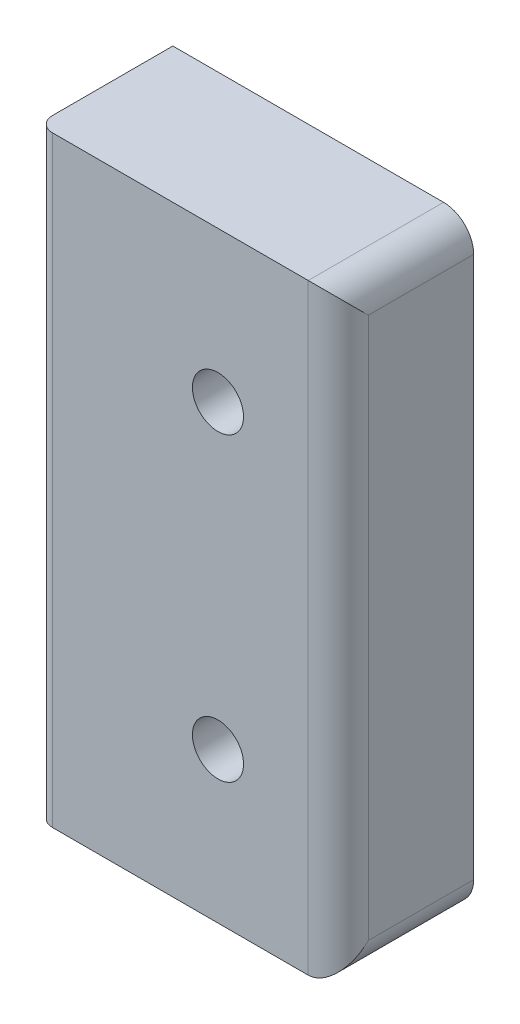
ISO-10303-21;
HEADER;
FILE_DESCRIPTION(('STEP AP214'),'2;1');
FILE_NAME('part.step','',(''),(''),'','','');
FILE_SCHEMA(('AUTOMOTIVE_DESIGN { 1 0 10303 214 1 1 1 1 }'));
ENDSEC;
DATA;
#1=APPLICATION_CONTEXT('core data for automotive mechanical design processes');
#2=APPLICATION_PROTOCOL_DEFINITION('international standard','automotive_design',2000,#1);
#3=PRODUCT_CONTEXT('',#1,'mechanical');
#4=PRODUCT('Part','Part','',(#3));
#5=PRODUCT_RELATED_PRODUCT_CATEGORY('part','',(#4));
#6=PRODUCT_DEFINITION_FORMATION('','',#4);
#7=PRODUCT_DEFINITION_CONTEXT('part definition',#1,'design');
#8=PRODUCT_DEFINITION('design','',#6,#7);
#9=PRODUCT_DEFINITION_SHAPE('','',#8);
#10=(LENGTH_UNIT() NAMED_UNIT(*) SI_UNIT(.MILLI.,.METRE.));
#11=(NAMED_UNIT(*) PLANE_ANGLE_UNIT() SI_UNIT($,.RADIAN.));
#12=(NAMED_UNIT(*) SI_UNIT($,.STERADIAN.) SOLID_ANGLE_UNIT());
#13=UNCERTAINTY_MEASURE_WITH_UNIT(LENGTH_MEASURE(1.E-05),#10,'distance_accuracy_value','');
#14=(GEOMETRIC_REPRESENTATION_CONTEXT(3) GLOBAL_UNCERTAINTY_ASSIGNED_CONTEXT((#13)) GLOBAL_UNIT_ASSIGNED_CONTEXT((#10,
#11,#12)) REPRESENTATION_CONTEXT('',''));
#15=CARTESIAN_POINT('',(0.,0.,0.));
#16=DIRECTION('',(0.,0.,1.));
#17=DIRECTION('',(1.,0.,0.));
#18=AXIS2_PLACEMENT_3D('',#15,#16,#17);
#19=CARTESIAN_POINT('',(10.,0.,9.));
#20=DIRECTION('',(0.,-1.,0.));
#21=DIRECTION('',(0.,0.,-1.));
#22=AXIS2_PLACEMENT_3D('',#19,#20,#21);
#23=PLANE('',#22);
#24=DIRECTION('',(-1.,0.,0.));
#25=VECTOR('',#24,1.);
#26=CARTESIAN_POINT('',(10.,0.,0.));
#27=LINE('',#26,#25);
#28=CARTESIAN_POINT('',(8.,0.,0.));
#29=VERTEX_POINT('',#28);
#30=CARTESIAN_POINT('',(-10.,0.,0.));
#31=VERTEX_POINT('',#30);
#32=EDGE_CURVE('E96',#29,#31,#27,.T.);
#33=ORIENTED_EDGE('',*,*,#32,.F.);
#34=DIRECTION('',(0.,0.,-1.));
#35=VECTOR('',#34,1.);
#36=CARTESIAN_POINT('',(8.,0.,9.));
#37=LINE('',#36,#35);
#38=CARTESIAN_POINT('',(8.,0.,9.));
#39=VERTEX_POINT('',#38);
#40=EDGE_CURVE('E59',#29,#39,#37,.F.);
#41=ORIENTED_EDGE('',*,*,#40,.T.);
#42=DIRECTION('',(-1.,0.,0.));
#43=VECTOR('',#42,1.);
#44=CARTESIAN_POINT('',(10.,0.,9.));
#45=LINE('',#44,#43);
#46=CARTESIAN_POINT('',(-9.,0.,9.));
#47=VERTEX_POINT('',#46);
#48=EDGE_CURVE('E126',#39,#47,#45,.T.);
#49=ORIENTED_EDGE('',*,*,#48,.T.);
#50=CARTESIAN_POINT('',(-9.,0.,8.));
#51=DIRECTION('',(0.,-1.,0.));
#52=DIRECTION('',(0.,0.,-1.));
#53=AXIS2_PLACEMENT_3D('',#50,#51,#52);
#54=CIRCLE('',#53,1.);
#55=CARTESIAN_POINT('',(-10.,0.,8.));
#56=VERTEX_POINT('',#55);
#57=EDGE_CURVE('E109',#47,#56,#54,.T.);
#58=ORIENTED_EDGE('',*,*,#57,.T.);
#59=DIRECTION('',(0.,0.,-1.));
#60=VECTOR('',#59,1.);
#61=CARTESIAN_POINT('',(-10.,0.,9.));
#62=LINE('',#61,#60);
#63=EDGE_CURVE('E107',#56,#31,#62,.T.);
#64=ORIENTED_EDGE('',*,*,#63,.T.);
#65=EDGE_LOOP('',(#33,#41,#49,#58,#64));
#66=FACE_BOUND('',#65,.T.);
#67=ADVANCED_FACE('F36',(#66),#23,.T.);
#68=CARTESIAN_POINT('',(10.,40.,9.));
#69=DIRECTION('',(1.,0.,0.));
#70=DIRECTION('',(0.,0.,-1.));
#71=AXIS2_PLACEMENT_3D('',#68,#69,#70);
#72=PLANE('',#71);
#73=DIRECTION('',(0.,-1.,0.));
#74=VECTOR('',#73,1.);
#75=CARTESIAN_POINT('',(10.,0.,7.));
#76=LINE('',#75,#74);
#77=CARTESIAN_POINT('',(10.,38.,7.));
#78=VERTEX_POINT('',#77);
#79=CARTESIAN_POINT('',(10.,2.,7.));
#80=VERTEX_POINT('',#79);
#81=EDGE_CURVE('E136',#78,#80,#76,.T.);
#82=ORIENTED_EDGE('',*,*,#81,.T.);
#83=DIRECTION('',(0.,0.,-1.));
#84=VECTOR('',#83,1.);
#85=CARTESIAN_POINT('',(10.,2.,9.));
#86=LINE('',#85,#84);
#87=CARTESIAN_POINT('',(10.,2.,0.));
#88=VERTEX_POINT('',#87);
#89=EDGE_CURVE('E140',#80,#88,#86,.T.);
#90=ORIENTED_EDGE('',*,*,#89,.T.);
#91=DIRECTION('',(0.,-1.,0.));
#92=VECTOR('',#91,1.);
#93=CARTESIAN_POINT('',(10.,40.,0.));
#94=LINE('',#93,#92);
#95=CARTESIAN_POINT('',(10.,38.,0.));
#96=VERTEX_POINT('',#95);
#97=EDGE_CURVE('E121',#96,#88,#94,.T.);
#98=ORIENTED_EDGE('',*,*,#97,.F.);
#99=DIRECTION('',(0.,0.,-1.));
#100=VECTOR('',#99,1.);
#101=CARTESIAN_POINT('',(10.,38.,9.));
#102=LINE('',#101,#100);
#103=EDGE_CURVE('E138',#96,#78,#102,.F.);
#104=ORIENTED_EDGE('',*,*,#103,.T.);
#105=EDGE_LOOP('',(#82,#90,#98,#104));
#106=FACE_BOUND('',#105,.T.);
#107=ADVANCED_FACE('F209',(#106),#72,.T.);
#108=CARTESIAN_POINT('',(-10.,40.,9.));
#109=DIRECTION('',(0.,1.,0.));
#110=DIRECTION('',(0.,0.,1.));
#111=AXIS2_PLACEMENT_3D('',#108,#109,#110);
#112=PLANE('',#111);
#113=DIRECTION('',(1.,0.,0.));
#114=VECTOR('',#113,1.);
#115=CARTESIAN_POINT('',(-10.,40.,9.));
#116=LINE('',#115,#114);
#117=CARTESIAN_POINT('',(-9.,40.,9.));
#118=VERTEX_POINT('',#117);
#119=CARTESIAN_POINT('',(8.,40.,9.));
#120=VERTEX_POINT('',#119);
#121=EDGE_CURVE('E114',#118,#120,#116,.T.);
#122=ORIENTED_EDGE('',*,*,#121,.T.);
#123=DIRECTION('',(0.,0.,-1.));
#124=VECTOR('',#123,1.);
#125=CARTESIAN_POINT('',(8.,40.,9.));
#126=LINE('',#125,#124);
#127=CARTESIAN_POINT('',(8.,40.,0.));
#128=VERTEX_POINT('',#127);
#129=EDGE_CURVE('E45',#120,#128,#126,.T.);
#130=ORIENTED_EDGE('',*,*,#129,.T.);
#131=DIRECTION('',(1.,0.,0.));
#132=VECTOR('',#131,1.);
#133=CARTESIAN_POINT('',(-10.,40.,0.));
#134=LINE('',#133,#132);
#135=CARTESIAN_POINT('',(-10.,40.,0.));
#136=VERTEX_POINT('',#135);
#137=EDGE_CURVE('E119',#136,#128,#134,.T.);
#138=ORIENTED_EDGE('',*,*,#137,.F.);
#139=DIRECTION('',(0.,0.,-1.));
#140=VECTOR('',#139,1.);
#141=CARTESIAN_POINT('',(-10.,40.,9.));
#142=LINE('',#141,#140);
#143=CARTESIAN_POINT('',(-10.,40.,8.));
#144=VERTEX_POINT('',#143);
#145=EDGE_CURVE('E113',#144,#136,#142,.T.);
#146=ORIENTED_EDGE('',*,*,#145,.F.);
#147=CARTESIAN_POINT('',(-9.,40.,8.));
#148=DIRECTION('',(0.,1.,0.));
#149=DIRECTION('',(0.,0.,1.));
#150=AXIS2_PLACEMENT_3D('',#147,#148,#149);
#151=CIRCLE('',#150,1.);
#152=EDGE_CURVE('E130',#144,#118,#151,.T.);
#153=ORIENTED_EDGE('',*,*,#152,.T.);
#154=EDGE_LOOP('',(#122,#130,#138,#146,#153));
#155=FACE_BOUND('',#154,.T.);
#156=ADVANCED_FACE('F202',(#155),#112,.T.);
#157=CARTESIAN_POINT('',(-10.,0.,9.));
#158=DIRECTION('',(-1.,0.,0.));
#159=DIRECTION('',(0.,0.,1.));
#160=AXIS2_PLACEMENT_3D('',#157,#158,#159);
#161=PLANE('',#160);
#162=CARTESIAN_POINT('',(-10.,25.,4.49999999999423));
#163=DIRECTION('',(-1.,0.,0.));
#164=DIRECTION('',(0.,0.,1.));
#165=AXIS2_PLACEMENT_3D('',#162,#163,#164);
#166=CIRCLE('',#165,2.);
#167=CARTESIAN_POINT('',(-10.,25.,6.49999999999423));
#168=VERTEX_POINT('',#167);
#169=EDGE_CURVE('E177',#168,#168,#166,.T.);
#170=ORIENTED_EDGE('',*,*,#169,.F.);
#171=EDGE_LOOP('',(#170));
#172=FACE_BOUND('',#171,.T.);
#173=CARTESIAN_POINT('',(-10.,5.00000000000016,4.49999999999425));
#174=DIRECTION('',(-1.,0.,0.));
#175=DIRECTION('',(0.,0.,1.));
#176=AXIS2_PLACEMENT_3D('',#173,#174,#175);
#177=CIRCLE('',#176,2.);
#178=CARTESIAN_POINT('',(-10.,5.00000000000016,6.49999999999425));
#179=VERTEX_POINT('',#178);
#180=EDGE_CURVE('E183',#179,#179,#177,.T.);
#181=ORIENTED_EDGE('',*,*,#180,.F.);
#182=EDGE_LOOP('',(#181));
#183=FACE_BOUND('',#182,.T.);
#184=CARTESIAN_POINT('',(-10.,15.,4.49999999999424));
#185=DIRECTION('',(-1.,0.,0.));
#186=DIRECTION('',(0.,0.,1.));
#187=AXIS2_PLACEMENT_3D('',#184,#185,#186);
#188=CIRCLE('',#187,2.);
#189=CARTESIAN_POINT('',(-10.,15.,6.49999999999424));
#190=VERTEX_POINT('',#189);
#191=EDGE_CURVE('E189',#190,#190,#188,.T.);
#192=ORIENTED_EDGE('',*,*,#191,.F.);
#193=EDGE_LOOP('',(#192));
#194=FACE_BOUND('',#193,.T.);
#195=CARTESIAN_POINT('',(-10.,35.,4.49999999999424));
#196=DIRECTION('',(-1.,0.,0.));
#197=DIRECTION('',(0.,0.,1.));
#198=AXIS2_PLACEMENT_3D('',#195,#196,#197);
#199=CIRCLE('',#198,2.);
#200=CARTESIAN_POINT('',(-10.,35.,6.49999999999424));
#201=VERTEX_POINT('',#200);
#202=EDGE_CURVE('E195',#201,#201,#199,.T.);
#203=ORIENTED_EDGE('',*,*,#202,.F.);
#204=EDGE_LOOP('',(#203));
#205=FACE_BOUND('',#204,.T.);
#206=ORIENTED_EDGE('',*,*,#63,.F.);
#207=DIRECTION('',(0.,1.,0.));
#208=VECTOR('',#207,1.);
#209=CARTESIAN_POINT('',(-10.,40.,8.));
#210=LINE('',#209,#208);
#211=EDGE_CURVE('E127',#56,#144,#210,.T.);
#212=ORIENTED_EDGE('',*,*,#211,.T.);
#213=ORIENTED_EDGE('',*,*,#145,.T.);
#214=DIRECTION('',(0.,1.,0.));
#215=VECTOR('',#214,1.);
#216=CARTESIAN_POINT('',(-10.,0.,0.));
#217=LINE('',#216,#215);
#218=EDGE_CURVE('E102',#31,#136,#217,.T.);
#219=ORIENTED_EDGE('',*,*,#218,.F.);
#220=EDGE_LOOP('',(#206,#212,#213,#219));
#221=FACE_BOUND('',#220,.T.);
#222=ADVANCED_FACE('F116',(#172,#183,#194,#205,#221),#161,.T.);
#223=CARTESIAN_POINT('',(0.,0.,9.));
#224=DIRECTION('',(0.,0.,-1.));
#225=DIRECTION('',(-1.,0.,0.));
#226=AXIS2_PLACEMENT_3D('',#223,#224,#225);
#227=PLANE('',#226);
#228=CARTESIAN_POINT('',(2.,30.,9.));
#229=DIRECTION('',(0.,0.,-1.));
#230=DIRECTION('',(-1.,0.,0.));
#231=AXIS2_PLACEMENT_3D('',#228,#229,#230);
#232=CIRCLE('',#231,1.7);
#233=CARTESIAN_POINT('',(0.300000000000004,30.,9.));
#234=VERTEX_POINT('',#233);
#235=EDGE_CURVE('E163',#234,#234,#232,.T.);
#236=ORIENTED_EDGE('',*,*,#235,.T.);
#237=EDGE_LOOP('',(#236));
#238=FACE_BOUND('',#237,.T.);
#239=CARTESIAN_POINT('',(2.,10.,9.));
#240=DIRECTION('',(0.,0.,-1.));
#241=DIRECTION('',(-1.,0.,0.));
#242=AXIS2_PLACEMENT_3D('',#239,#240,#241);
#243=CIRCLE('',#242,1.7);
#244=CARTESIAN_POINT('',(0.300000000000004,10.,9.));
#245=VERTEX_POINT('',#244);
#246=EDGE_CURVE('E174',#245,#245,#243,.T.);
#247=ORIENTED_EDGE('',*,*,#246,.T.);
#248=EDGE_LOOP('',(#247));
#249=FACE_BOUND('',#248,.T.);
#250=ORIENTED_EDGE('',*,*,#48,.F.);
#251=DIRECTION('',(0.,-1.,0.));
#252=VECTOR('',#251,1.);
#253=CARTESIAN_POINT('',(8.,40.,9.));
#254=LINE('',#253,#252);
#255=EDGE_CURVE('E11',#39,#120,#254,.F.);
#256=ORIENTED_EDGE('',*,*,#255,.T.);
#257=ORIENTED_EDGE('',*,*,#121,.F.);
#258=DIRECTION('',(0.,1.,0.));
#259=VECTOR('',#258,1.);
#260=CARTESIAN_POINT('',(-9.,0.,9.));
#261=LINE('',#260,#259);
#262=EDGE_CURVE('E132',#118,#47,#261,.F.);
#263=ORIENTED_EDGE('',*,*,#262,.T.);
#264=EDGE_LOOP('',(#250,#256,#257,#263));
#265=FACE_BOUND('',#264,.T.);
#266=ADVANCED_FACE('F237',(#238,#249,#265),#227,.F.);
#267=CARTESIAN_POINT('',(0.,0.,0.));
#268=DIRECTION('',(0.,0.,-1.));
#269=DIRECTION('',(-1.,0.,0.));
#270=AXIS2_PLACEMENT_3D('',#267,#268,#269);
#271=PLANE('',#270);
#272=CARTESIAN_POINT('',(2.,30.,0.));
#273=DIRECTION('',(0.,0.,-1.));
#274=DIRECTION('',(-1.,0.,0.));
#275=AXIS2_PLACEMENT_3D('',#272,#273,#274);
#276=CIRCLE('',#275,2.75);
#277=CARTESIAN_POINT('',(-0.749999999999999,30.,0.));
#278=VERTEX_POINT('',#277);
#279=EDGE_CURVE('E153',#278,#278,#276,.T.);
#280=ORIENTED_EDGE('',*,*,#279,.F.);
#281=EDGE_LOOP('',(#280));
#282=FACE_BOUND('',#281,.T.);
#283=CARTESIAN_POINT('',(2.,10.,0.));
#284=DIRECTION('',(0.,0.,-1.));
#285=DIRECTION('',(-1.,0.,0.));
#286=AXIS2_PLACEMENT_3D('',#283,#284,#285);
#287=CIRCLE('',#286,2.75);
#288=CARTESIAN_POINT('',(-0.749999999999999,10.,0.));
#289=VERTEX_POINT('',#288);
#290=EDGE_CURVE('E168',#289,#289,#287,.T.);
#291=ORIENTED_EDGE('',*,*,#290,.F.);
#292=EDGE_LOOP('',(#291));
#293=FACE_BOUND('',#292,.T.);
#294=ORIENTED_EDGE('',*,*,#97,.T.);
#295=CARTESIAN_POINT('',(8.,2.,0.));
#296=DIRECTION('',(0.,0.,-1.));
#297=DIRECTION('',(-1.,0.,0.));
#298=AXIS2_PLACEMENT_3D('',#295,#296,#297);
#299=CIRCLE('',#298,2.);
#300=EDGE_CURVE('E103',#88,#29,#299,.T.);
#301=ORIENTED_EDGE('',*,*,#300,.T.);
#302=ORIENTED_EDGE('',*,*,#32,.T.);
#303=ORIENTED_EDGE('',*,*,#218,.T.);
#304=ORIENTED_EDGE('',*,*,#137,.T.);
#305=CARTESIAN_POINT('',(8.,38.,0.));
#306=DIRECTION('',(0.,0.,-1.));
#307=DIRECTION('',(-1.,0.,0.));
#308=AXIS2_PLACEMENT_3D('',#305,#306,#307);
#309=CIRCLE('',#308,2.);
#310=EDGE_CURVE('E143',#128,#96,#309,.T.);
#311=ORIENTED_EDGE('',*,*,#310,.T.);
#312=EDGE_LOOP('',(#294,#301,#302,#303,#304,#311));
#313=FACE_BOUND('',#312,.T.);
#314=ADVANCED_FACE('F99',(#282,#293,#313),#271,.T.);
#315=CARTESIAN_POINT('',(-4.,35.,4.49999999999424));
#316=DIRECTION('',(1.,0.,0.));
#317=DIRECTION('',(0.,0.,-1.));
#318=AXIS2_PLACEMENT_3D('',#315,#316,#317);
#319=PLANE('',#318);
#320=CARTESIAN_POINT('',(-4.,35.,4.49999999999424));
#321=DIRECTION('',(-1.,0.,0.));
#322=DIRECTION('',(0.,0.,1.));
#323=AXIS2_PLACEMENT_3D('',#320,#321,#322);
#324=CIRCLE('',#323,1.99999999999999);
#325=CARTESIAN_POINT('',(-4.,35.,6.49999999999423));
#326=VERTEX_POINT('',#325);
#327=EDGE_CURVE('E104',#326,#326,#324,.T.);
#328=ORIENTED_EDGE('',*,*,#327,.T.);
#329=EDGE_LOOP('',(#328));
#330=FACE_BOUND('',#329,.T.);
#331=ADVANCED_FACE('F244',(#330),#319,.F.);
#332=CARTESIAN_POINT('',(-10.,35.,4.49999999999424));
#333=DIRECTION('',(-1.,0.,0.));
#334=DIRECTION('',(0.,0.,1.));
#335=AXIS2_PLACEMENT_3D('',#332,#333,#334);
#336=CYLINDRICAL_SURFACE('',#335,2.);
#337=ORIENTED_EDGE('',*,*,#327,.F.);
#338=EDGE_LOOP('',(#337));
#339=FACE_BOUND('',#338,.T.);
#340=ORIENTED_EDGE('',*,*,#202,.T.);
#341=EDGE_LOOP('',(#340));
#342=FACE_BOUND('',#341,.T.);
#343=ADVANCED_FACE('F327',(#339,#342),#336,.F.);
#344=CARTESIAN_POINT('',(-4.,15.,4.49999999999424));
#345=DIRECTION('',(1.,0.,0.));
#346=DIRECTION('',(0.,0.,-1.));
#347=AXIS2_PLACEMENT_3D('',#344,#345,#346);
#348=PLANE('',#347);
#349=CARTESIAN_POINT('',(-4.,15.,4.49999999999424));
#350=DIRECTION('',(-1.,0.,0.));
#351=DIRECTION('',(0.,0.,1.));
#352=AXIS2_PLACEMENT_3D('',#349,#350,#351);
#353=CIRCLE('',#352,2.);
#354=CARTESIAN_POINT('',(-4.,15.,6.49999999999424));
#355=VERTEX_POINT('',#354);
#356=EDGE_CURVE('E192',#355,#355,#353,.T.);
#357=ORIENTED_EDGE('',*,*,#356,.T.);
#358=EDGE_LOOP('',(#357));
#359=FACE_BOUND('',#358,.T.);
#360=ADVANCED_FACE('F319',(#359),#348,.F.);
#361=CARTESIAN_POINT('',(-10.,15.,4.49999999999424));
#362=DIRECTION('',(-1.,0.,0.));
#363=DIRECTION('',(0.,0.,1.));
#364=AXIS2_PLACEMENT_3D('',#361,#362,#363);
#365=CYLINDRICAL_SURFACE('',#364,2.);
#366=ORIENTED_EDGE('',*,*,#356,.F.);
#367=EDGE_LOOP('',(#366));
#368=FACE_BOUND('',#367,.T.);
#369=ORIENTED_EDGE('',*,*,#191,.T.);
#370=EDGE_LOOP('',(#369));
#371=FACE_BOUND('',#370,.T.);
#372=ADVANCED_FACE('F311',(#368,#371),#365,.F.);
#373=CARTESIAN_POINT('',(-4.,5.00000000000016,4.49999999999425));
#374=DIRECTION('',(1.,0.,0.));
#375=DIRECTION('',(0.,0.,-1.));
#376=AXIS2_PLACEMENT_3D('',#373,#374,#375);
#377=PLANE('',#376);
#378=CARTESIAN_POINT('',(-4.,5.00000000000016,4.49999999999425));
#379=DIRECTION('',(-1.,0.,0.));
#380=DIRECTION('',(0.,0.,1.));
#381=AXIS2_PLACEMENT_3D('',#378,#379,#380);
#382=CIRCLE('',#381,2.);
#383=CARTESIAN_POINT('',(-4.,5.00000000000016,6.49999999999425));
#384=VERTEX_POINT('',#383);
#385=EDGE_CURVE('E186',#384,#384,#382,.T.);
#386=ORIENTED_EDGE('',*,*,#385,.T.);
#387=EDGE_LOOP('',(#386));
#388=FACE_BOUND('',#387,.T.);
#389=ADVANCED_FACE('F303',(#388),#377,.F.);
#390=CARTESIAN_POINT('',(-10.,5.00000000000016,4.49999999999425));
#391=DIRECTION('',(-1.,0.,0.));
#392=DIRECTION('',(0.,0.,1.));
#393=AXIS2_PLACEMENT_3D('',#390,#391,#392);
#394=CYLINDRICAL_SURFACE('',#393,2.);
#395=ORIENTED_EDGE('',*,*,#385,.F.);
#396=EDGE_LOOP('',(#395));
#397=FACE_BOUND('',#396,.T.);
#398=ORIENTED_EDGE('',*,*,#180,.T.);
#399=EDGE_LOOP('',(#398));
#400=FACE_BOUND('',#399,.T.);
#401=ADVANCED_FACE('F295',(#397,#400),#394,.F.);
#402=CARTESIAN_POINT('',(-4.,25.,4.49999999999423));
#403=DIRECTION('',(1.,0.,0.));
#404=DIRECTION('',(0.,0.,-1.));
#405=AXIS2_PLACEMENT_3D('',#402,#403,#404);
#406=PLANE('',#405);
#407=CARTESIAN_POINT('',(-4.,25.,4.49999999999423));
#408=DIRECTION('',(-1.,0.,0.));
#409=DIRECTION('',(0.,0.,1.));
#410=AXIS2_PLACEMENT_3D('',#407,#408,#409);
#411=CIRCLE('',#410,2.);
#412=CARTESIAN_POINT('',(-4.,25.,6.49999999999423));
#413=VERTEX_POINT('',#412);
#414=EDGE_CURVE('E180',#413,#413,#411,.T.);
#415=ORIENTED_EDGE('',*,*,#414,.T.);
#416=EDGE_LOOP('',(#415));
#417=FACE_BOUND('',#416,.T.);
#418=ADVANCED_FACE('F287',(#417),#406,.F.);
#419=CARTESIAN_POINT('',(-10.,25.,4.49999999999423));
#420=DIRECTION('',(-1.,0.,0.));
#421=DIRECTION('',(0.,0.,1.));
#422=AXIS2_PLACEMENT_3D('',#419,#420,#421);
#423=CYLINDRICAL_SURFACE('',#422,2.);
#424=ORIENTED_EDGE('',*,*,#414,.F.);
#425=EDGE_LOOP('',(#424));
#426=FACE_BOUND('',#425,.T.);
#427=ORIENTED_EDGE('',*,*,#169,.T.);
#428=EDGE_LOOP('',(#427));
#429=FACE_BOUND('',#428,.T.);
#430=ADVANCED_FACE('F279',(#426,#429),#423,.F.);
#431=CARTESIAN_POINT('',(2.,10.,0.));
#432=DIRECTION('',(0.,0.,-1.));
#433=DIRECTION('',(-1.,0.,0.));
#434=AXIS2_PLACEMENT_3D('',#431,#432,#433);
#435=CYLINDRICAL_SURFACE('',#434,1.7);
#436=ORIENTED_EDGE('',*,*,#246,.F.);
#437=EDGE_LOOP('',(#436));
#438=FACE_BOUND('',#437,.T.);
#439=CARTESIAN_POINT('',(2.,10.,1.05));
#440=DIRECTION('',(0.,0.,-1.));
#441=DIRECTION('',(-1.,0.,0.));
#442=AXIS2_PLACEMENT_3D('',#439,#440,#441);
#443=CIRCLE('',#442,1.7);
#444=CARTESIAN_POINT('',(0.300000000000002,10.,1.05));
#445=VERTEX_POINT('',#444);
#446=EDGE_CURVE('E171',#445,#445,#443,.T.);
#447=ORIENTED_EDGE('',*,*,#446,.T.);
#448=EDGE_LOOP('',(#447));
#449=FACE_BOUND('',#448,.T.);
#450=ADVANCED_FACE('F271',(#438,#449),#435,.F.);
#451=CARTESIAN_POINT('',(2.,10.,0.));
#452=DIRECTION('',(0.,0.,-1.));
#453=DIRECTION('',(-1.,0.,0.));
#454=AXIS2_PLACEMENT_3D('',#451,#452,#453);
#455=CONICAL_SURFACE('',#454,2.75,0.785398163397447);
#456=ORIENTED_EDGE('',*,*,#446,.F.);
#457=EDGE_LOOP('',(#456));
#458=FACE_BOUND('',#457,.T.);
#459=ORIENTED_EDGE('',*,*,#290,.T.);
#460=EDGE_LOOP('',(#459));
#461=FACE_BOUND('',#460,.T.);
#462=ADVANCED_FACE('F263',(#458,#461),#455,.F.);
#463=CARTESIAN_POINT('',(2.,30.,0.));
#464=DIRECTION('',(0.,0.,-1.));
#465=DIRECTION('',(-1.,0.,0.));
#466=AXIS2_PLACEMENT_3D('',#463,#464,#465);
#467=CYLINDRICAL_SURFACE('',#466,1.7);
#468=ORIENTED_EDGE('',*,*,#235,.F.);
#469=EDGE_LOOP('',(#468));
#470=FACE_BOUND('',#469,.T.);
#471=CARTESIAN_POINT('',(2.,30.,1.05));
#472=DIRECTION('',(0.,0.,-1.));
#473=DIRECTION('',(-1.,0.,0.));
#474=AXIS2_PLACEMENT_3D('',#471,#472,#473);
#475=CIRCLE('',#474,1.7);
#476=CARTESIAN_POINT('',(0.300000000000002,30.,1.05));
#477=VERTEX_POINT('',#476);
#478=EDGE_CURVE('E158',#477,#477,#475,.T.);
#479=ORIENTED_EDGE('',*,*,#478,.T.);
#480=EDGE_LOOP('',(#479));
#481=FACE_BOUND('',#480,.T.);
#482=ADVANCED_FACE('F234',(#470,#481),#467,.F.);
#483=CARTESIAN_POINT('',(2.,30.,0.));
#484=DIRECTION('',(0.,0.,-1.));
#485=DIRECTION('',(-1.,0.,0.));
#486=AXIS2_PLACEMENT_3D('',#483,#484,#485);
#487=CONICAL_SURFACE('',#486,2.75,0.785398163397447);
#488=ORIENTED_EDGE('',*,*,#478,.F.);
#489=EDGE_LOOP('',(#488));
#490=FACE_BOUND('',#489,.T.);
#491=ORIENTED_EDGE('',*,*,#279,.T.);
#492=EDGE_LOOP('',(#491));
#493=FACE_BOUND('',#492,.T.);
#494=ADVANCED_FACE('F228',(#490,#493),#487,.F.);
#495=CARTESIAN_POINT('',(-9.,0.,8.));
#496=DIRECTION('',(0.,-1.,0.));
#497=DIRECTION('',(0.,0.,-1.));
#498=AXIS2_PLACEMENT_3D('',#495,#496,#497);
#499=CYLINDRICAL_SURFACE('',#498,1.);
#500=ORIENTED_EDGE('',*,*,#57,.F.);
#501=ORIENTED_EDGE('',*,*,#262,.F.);
#502=ORIENTED_EDGE('',*,*,#152,.F.);
#503=ORIENTED_EDGE('',*,*,#211,.F.);
#504=EDGE_LOOP('',(#500,#501,#502,#503));
#505=FACE_BOUND('',#504,.T.);
#506=ADVANCED_FACE('F226',(#505),#499,.T.);
#507=CARTESIAN_POINT('',(8.,38.,9.));
#508=DIRECTION('',(0.,0.,-1.));
#509=DIRECTION('',(-1.,0.,0.));
#510=AXIS2_PLACEMENT_3D('',#507,#508,#509);
#511=CYLINDRICAL_SURFACE('',#510,2.);
#512=ORIENTED_EDGE('',*,*,#310,.F.);
#513=ORIENTED_EDGE('',*,*,#129,.F.);
#514=CARTESIAN_POINT('',(8.,38.,7.));
#515=DIRECTION('',(0.,0.707106781186547,-0.707106781186547));
#516=DIRECTION('',(0.,0.707106781186547,0.707106781186547));
#517=AXIS2_PLACEMENT_3D('',#514,#515,#516);
#518=ELLIPSE('',#517,2.82842712474619,2.);
#519=EDGE_CURVE('E40',#78,#120,#518,.F.);
#520=ORIENTED_EDGE('',*,*,#519,.F.);
#521=ORIENTED_EDGE('',*,*,#103,.F.);
#522=EDGE_LOOP('',(#512,#513,#520,#521));
#523=FACE_BOUND('',#522,.T.);
#524=ADVANCED_FACE('F38',(#523),#511,.T.);
#525=CARTESIAN_POINT('',(8.,40.,7.));
#526=DIRECTION('',(0.,1.,0.));
#527=DIRECTION('',(0.,0.,1.));
#528=AXIS2_PLACEMENT_3D('',#525,#526,#527);
#529=CYLINDRICAL_SURFACE('',#528,2.);
#530=ORIENTED_EDGE('',*,*,#519,.T.);
#531=ORIENTED_EDGE('',*,*,#255,.F.);
#532=CARTESIAN_POINT('',(8.,2.,7.));
#533=DIRECTION('',(0.,0.707106781186547,0.707106781186547));
#534=DIRECTION('',(0.,0.707106781186547,-0.707106781186547));
#535=AXIS2_PLACEMENT_3D('',#532,#533,#534);
#536=ELLIPSE('',#535,2.82842712474619,2.);
#537=EDGE_CURVE('E147',#80,#39,#536,.F.);
#538=ORIENTED_EDGE('',*,*,#537,.F.);
#539=ORIENTED_EDGE('',*,*,#81,.F.);
#540=EDGE_LOOP('',(#530,#531,#538,#539));
#541=FACE_BOUND('',#540,.T.);
#542=ADVANCED_FACE('F212',(#541),#529,.T.);
#543=CARTESIAN_POINT('',(8.,2.,9.));
#544=DIRECTION('',(0.,0.,-1.));
#545=DIRECTION('',(-1.,0.,0.));
#546=AXIS2_PLACEMENT_3D('',#543,#544,#545);
#547=CYLINDRICAL_SURFACE('',#546,2.);
#548=ORIENTED_EDGE('',*,*,#537,.T.);
#549=ORIENTED_EDGE('',*,*,#40,.F.);
#550=ORIENTED_EDGE('',*,*,#300,.F.);
#551=ORIENTED_EDGE('',*,*,#89,.F.);
#552=EDGE_LOOP('',(#548,#549,#550,#551));
#553=FACE_BOUND('',#552,.T.);
#554=ADVANCED_FACE('F210',(#553),#547,.T.);
#555=CLOSED_SHELL('',(#67,#107,#156,#222,#266,#314,#331,#343,#360,#372,#389,#401,#418,#430,#450,
#462,#482,#494,#506,#524,#542,#554));
#556=MANIFOLD_SOLID_BREP('B2',#555);
#557=ADVANCED_BREP_SHAPE_REPRESENTATION('',(#18,#556),#14);
#558=SHAPE_DEFINITION_REPRESENTATION(#9,#557);
ENDSEC;
END-ISO-10303-21;
